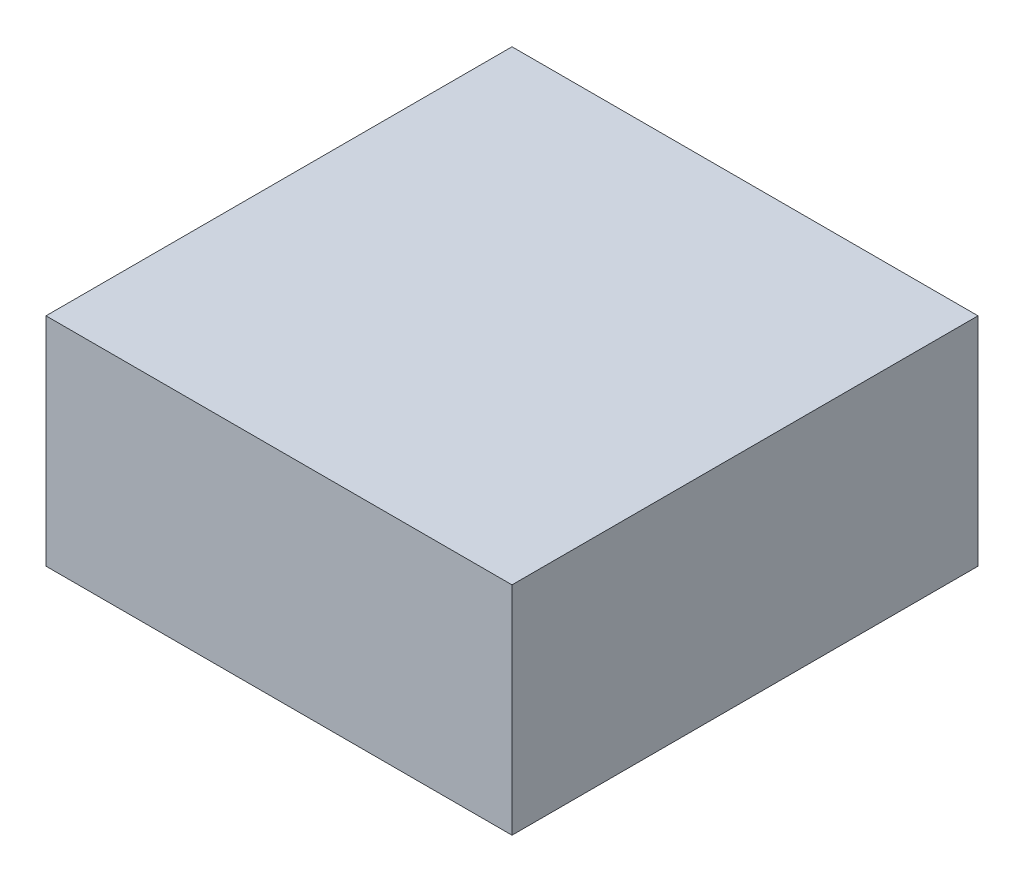
ISO-10303-21;
HEADER;
FILE_DESCRIPTION(('STEP AP214'),'2;1');
FILE_NAME('part.step','',(''),(''),'','','');
FILE_SCHEMA(('AUTOMOTIVE_DESIGN { 1 0 10303 214 1 1 1 1 }'));
ENDSEC;
DATA;
#1=APPLICATION_CONTEXT('core data for automotive mechanical design processes');
#2=APPLICATION_PROTOCOL_DEFINITION('international standard','automotive_design',2000,#1);
#3=PRODUCT_CONTEXT('',#1,'mechanical');
#4=PRODUCT('Part','Part','',(#3));
#5=PRODUCT_RELATED_PRODUCT_CATEGORY('part','',(#4));
#6=PRODUCT_DEFINITION_FORMATION('','',#4);
#7=PRODUCT_DEFINITION_CONTEXT('part definition',#1,'design');
#8=PRODUCT_DEFINITION('design','',#6,#7);
#9=PRODUCT_DEFINITION_SHAPE('','',#8);
#10=(LENGTH_UNIT() NAMED_UNIT(*) SI_UNIT(.MILLI.,.METRE.));
#11=(NAMED_UNIT(*) PLANE_ANGLE_UNIT() SI_UNIT($,.RADIAN.));
#12=(NAMED_UNIT(*) SI_UNIT($,.STERADIAN.) SOLID_ANGLE_UNIT());
#13=UNCERTAINTY_MEASURE_WITH_UNIT(LENGTH_MEASURE(1.E-05),#10,'distance_accuracy_value','');
#14=(GEOMETRIC_REPRESENTATION_CONTEXT(3) GLOBAL_UNCERTAINTY_ASSIGNED_CONTEXT((#13)) GLOBAL_UNIT_ASSIGNED_CONTEXT((#10,
#11,#12)) REPRESENTATION_CONTEXT('',''));
#15=CARTESIAN_POINT('',(0.,0.,0.));
#16=DIRECTION('',(0.,0.,1.));
#17=DIRECTION('',(1.,0.,0.));
#18=AXIS2_PLACEMENT_3D('',#15,#16,#17);
#19=CARTESIAN_POINT('',(25.25,23.5,25.25));
#20=DIRECTION('',(-1.,0.,0.));
#21=DIRECTION('',(0.,0.,1.));
#22=AXIS2_PLACEMENT_3D('',#19,#20,#21);
#23=PLANE('',#22);
#24=DIRECTION('',(0.,0.,-1.));
#25=VECTOR('',#24,1.);
#26=CARTESIAN_POINT('',(25.25,0.,25.25));
#27=LINE('',#26,#25);
#28=CARTESIAN_POINT('',(25.25,0.,25.25));
#29=VERTEX_POINT('',#28);
#30=CARTESIAN_POINT('',(25.25,0.,-25.25));
#31=VERTEX_POINT('',#30);
#32=EDGE_CURVE('E95',#29,#31,#27,.T.);
#33=ORIENTED_EDGE('',*,*,#32,.T.);
#34=DIRECTION('',(0.,-1.,0.));
#35=VECTOR('',#34,1.);
#36=CARTESIAN_POINT('',(25.25,23.5,-25.25));
#37=LINE('',#36,#35);
#38=CARTESIAN_POINT('',(25.25,23.5,-25.25));
#39=VERTEX_POINT('',#38);
#40=EDGE_CURVE('E11',#39,#31,#37,.T.);
#41=ORIENTED_EDGE('',*,*,#40,.F.);
#42=DIRECTION('',(0.,0.,-1.));
#43=VECTOR('',#42,1.);
#44=CARTESIAN_POINT('',(25.25,23.5,25.25));
#45=LINE('',#44,#43);
#46=CARTESIAN_POINT('',(25.25,23.5,25.25));
#47=VERTEX_POINT('',#46);
#48=EDGE_CURVE('E83',#47,#39,#45,.T.);
#49=ORIENTED_EDGE('',*,*,#48,.F.);
#50=DIRECTION('',(0.,-1.,0.));
#51=VECTOR('',#50,1.);
#52=CARTESIAN_POINT('',(25.25,23.5,25.25));
#53=LINE('',#52,#51);
#54=EDGE_CURVE('E91',#47,#29,#53,.T.);
#55=ORIENTED_EDGE('',*,*,#54,.T.);
#56=EDGE_LOOP('',(#33,#41,#49,#55));
#57=FACE_BOUND('',#56,.T.);
#58=ADVANCED_FACE('F32',(#57),#23,.F.);
#59=CARTESIAN_POINT('',(-25.2499999999999,23.5,-25.25));
#60=DIRECTION('',(0.,0.,1.));
#61=DIRECTION('',(1.,0.,0.));
#62=AXIS2_PLACEMENT_3D('',#59,#60,#61);
#63=PLANE('',#62);
#64=DIRECTION('',(-1.,0.,0.));
#65=VECTOR('',#64,1.);
#66=CARTESIAN_POINT('',(-25.2499999999999,0.,-25.25));
#67=LINE('',#66,#65);
#68=CARTESIAN_POINT('',(-25.2499999999999,0.,-25.25));
#69=VERTEX_POINT('',#68);
#70=EDGE_CURVE('E87',#31,#69,#67,.T.);
#71=ORIENTED_EDGE('',*,*,#70,.T.);
#72=DIRECTION('',(0.,-1.,0.));
#73=VECTOR('',#72,1.);
#74=CARTESIAN_POINT('',(-25.2499999999999,23.5,-25.25));
#75=LINE('',#74,#73);
#76=CARTESIAN_POINT('',(-25.2499999999999,23.5,-25.25));
#77=VERTEX_POINT('',#76);
#78=EDGE_CURVE('E40',#77,#69,#75,.T.);
#79=ORIENTED_EDGE('',*,*,#78,.F.);
#80=DIRECTION('',(-1.,0.,0.));
#81=VECTOR('',#80,1.);
#82=CARTESIAN_POINT('',(-25.2499999999999,23.5,-25.25));
#83=LINE('',#82,#81);
#84=EDGE_CURVE('E78',#39,#77,#83,.T.);
#85=ORIENTED_EDGE('',*,*,#84,.F.);
#86=ORIENTED_EDGE('',*,*,#40,.T.);
#87=EDGE_LOOP('',(#71,#79,#85,#86));
#88=FACE_BOUND('',#87,.T.);
#89=ADVANCED_FACE('F86',(#88),#63,.F.);
#90=CARTESIAN_POINT('',(-25.2499999999999,23.5,25.25));
#91=DIRECTION('',(1.,0.,0.));
#92=DIRECTION('',(0.,0.,-1.));
#93=AXIS2_PLACEMENT_3D('',#90,#91,#92);
#94=PLANE('',#93);
#95=DIRECTION('',(0.,0.,1.));
#96=VECTOR('',#95,1.);
#97=CARTESIAN_POINT('',(-25.2499999999999,0.,25.25));
#98=LINE('',#97,#96);
#99=CARTESIAN_POINT('',(-25.2499999999999,0.,25.25));
#100=VERTEX_POINT('',#99);
#101=EDGE_CURVE('E65',#69,#100,#98,.T.);
#102=ORIENTED_EDGE('',*,*,#101,.T.);
#103=DIRECTION('',(0.,-1.,0.));
#104=VECTOR('',#103,1.);
#105=CARTESIAN_POINT('',(-25.2499999999999,23.5,25.25));
#106=LINE('',#105,#104);
#107=CARTESIAN_POINT('',(-25.2499999999999,23.5,25.25));
#108=VERTEX_POINT('',#107);
#109=EDGE_CURVE('E88',#108,#100,#106,.T.);
#110=ORIENTED_EDGE('',*,*,#109,.F.);
#111=DIRECTION('',(0.,0.,1.));
#112=VECTOR('',#111,1.);
#113=CARTESIAN_POINT('',(-25.2499999999999,23.5,25.25));
#114=LINE('',#113,#112);
#115=EDGE_CURVE('E81',#77,#108,#114,.T.);
#116=ORIENTED_EDGE('',*,*,#115,.F.);
#117=ORIENTED_EDGE('',*,*,#78,.T.);
#118=EDGE_LOOP('',(#102,#110,#116,#117));
#119=FACE_BOUND('',#118,.T.);
#120=ADVANCED_FACE('F89',(#119),#94,.F.);
#121=CARTESIAN_POINT('',(-25.2499999999999,23.5,25.25));
#122=DIRECTION('',(0.,0.,-1.));
#123=DIRECTION('',(-1.,0.,0.));
#124=AXIS2_PLACEMENT_3D('',#121,#122,#123);
#125=PLANE('',#124);
#126=DIRECTION('',(1.,0.,0.));
#127=VECTOR('',#126,1.);
#128=CARTESIAN_POINT('',(-25.2499999999999,0.,25.25));
#129=LINE('',#128,#127);
#130=EDGE_CURVE('E71',#100,#29,#129,.T.);
#131=ORIENTED_EDGE('',*,*,#130,.T.);
#132=ORIENTED_EDGE('',*,*,#54,.F.);
#133=DIRECTION('',(1.,0.,0.));
#134=VECTOR('',#133,1.);
#135=CARTESIAN_POINT('',(-25.2499999999999,23.5,25.25));
#136=LINE('',#135,#134);
#137=EDGE_CURVE('E48',#108,#47,#136,.T.);
#138=ORIENTED_EDGE('',*,*,#137,.F.);
#139=ORIENTED_EDGE('',*,*,#109,.T.);
#140=EDGE_LOOP('',(#131,#132,#138,#139));
#141=FACE_BOUND('',#140,.T.);
#142=ADVANCED_FACE('F102',(#141),#125,.F.);
#143=CARTESIAN_POINT('',(25.25,23.5,-25.25));
#144=DIRECTION('',(0.,-1.,0.));
#145=DIRECTION('',(0.,0.,-1.));
#146=AXIS2_PLACEMENT_3D('',#143,#144,#145);
#147=PLANE('',#146);
#148=ORIENTED_EDGE('',*,*,#48,.T.);
#149=ORIENTED_EDGE('',*,*,#84,.T.);
#150=ORIENTED_EDGE('',*,*,#115,.T.);
#151=ORIENTED_EDGE('',*,*,#137,.T.);
#152=EDGE_LOOP('',(#148,#149,#150,#151));
#153=FACE_BOUND('',#152,.T.);
#154=ADVANCED_FACE('F79',(#153),#147,.F.);
#155=CARTESIAN_POINT('',(25.25,0.,-25.25));
#156=DIRECTION('',(0.,-1.,0.));
#157=DIRECTION('',(0.,0.,-1.));
#158=AXIS2_PLACEMENT_3D('',#155,#156,#157);
#159=PLANE('',#158);
#160=ORIENTED_EDGE('',*,*,#32,.F.);
#161=ORIENTED_EDGE('',*,*,#130,.F.);
#162=ORIENTED_EDGE('',*,*,#101,.F.);
#163=ORIENTED_EDGE('',*,*,#70,.F.);
#164=EDGE_LOOP('',(#160,#161,#162,#163));
#165=FACE_BOUND('',#164,.T.);
#166=ADVANCED_FACE('F105',(#165),#159,.T.);
#167=CLOSED_SHELL('',(#58,#89,#120,#142,#154,#166));
#168=MANIFOLD_SOLID_BREP('B2',#167);
#169=ADVANCED_BREP_SHAPE_REPRESENTATION('',(#18,#168),#14);
#170=SHAPE_DEFINITION_REPRESENTATION(#9,#169);
ENDSEC;
END-ISO-10303-21;
